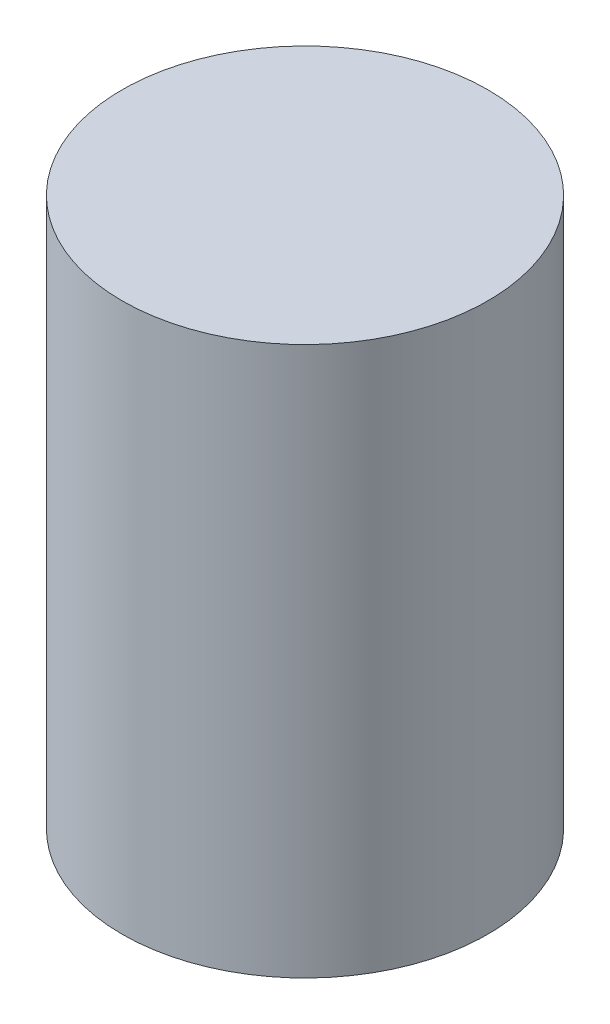
ISO-10303-21;
HEADER;
FILE_DESCRIPTION(('STEP AP214'),'2;1');
FILE_NAME('part.step','',(''),(''),'','','');
FILE_SCHEMA(('AUTOMOTIVE_DESIGN { 1 0 10303 214 1 1 1 1 }'));
ENDSEC;
DATA;
#1=APPLICATION_CONTEXT('core data for automotive mechanical design processes');
#2=APPLICATION_PROTOCOL_DEFINITION('international standard','automotive_design',2000,#1);
#3=PRODUCT_CONTEXT('',#1,'mechanical');
#4=PRODUCT('Part','Part','',(#3));
#5=PRODUCT_RELATED_PRODUCT_CATEGORY('part','',(#4));
#6=PRODUCT_DEFINITION_FORMATION('','',#4);
#7=PRODUCT_DEFINITION_CONTEXT('part definition',#1,'design');
#8=PRODUCT_DEFINITION('design','',#6,#7);
#9=PRODUCT_DEFINITION_SHAPE('','',#8);
#10=(LENGTH_UNIT() NAMED_UNIT(*) SI_UNIT(.MILLI.,.METRE.));
#11=(NAMED_UNIT(*) PLANE_ANGLE_UNIT() SI_UNIT($,.RADIAN.));
#12=(NAMED_UNIT(*) SI_UNIT($,.STERADIAN.) SOLID_ANGLE_UNIT());
#13=UNCERTAINTY_MEASURE_WITH_UNIT(LENGTH_MEASURE(1.E-05),#10,'distance_accuracy_value','');
#14=(GEOMETRIC_REPRESENTATION_CONTEXT(3) GLOBAL_UNCERTAINTY_ASSIGNED_CONTEXT((#13)) GLOBAL_UNIT_ASSIGNED_CONTEXT((#10,
#11,#12)) REPRESENTATION_CONTEXT('',''));
#15=CARTESIAN_POINT('',(0.,0.,0.));
#16=DIRECTION('',(0.,0.,1.));
#17=DIRECTION('',(1.,0.,0.));
#18=AXIS2_PLACEMENT_3D('',#15,#16,#17);
#19=CARTESIAN_POINT('',(0.,1500.,0.));
#20=DIRECTION('',(0.,-1.,0.));
#21=DIRECTION('',(0.,0.,-1.));
#22=AXIS2_PLACEMENT_3D('',#19,#20,#21);
#23=CYLINDRICAL_SURFACE('',#22,500.);
#24=CARTESIAN_POINT('',(0.,1500.,0.));
#25=DIRECTION('',(0.,1.,0.));
#26=DIRECTION('',(0.,0.,1.));
#27=AXIS2_PLACEMENT_3D('',#24,#25,#26);
#28=CIRCLE('',#27,500.);
#29=CARTESIAN_POINT('',(0.,1500.,500.));
#30=VERTEX_POINT('',#29);
#31=EDGE_CURVE('E10',#30,#30,#28,.T.);
#32=ORIENTED_EDGE('',*,*,#31,.F.);
#33=EDGE_LOOP('',(#32));
#34=FACE_BOUND('',#33,.T.);
#35=CARTESIAN_POINT('',(0.,0.,0.));
#36=DIRECTION('',(0.,1.,0.));
#37=DIRECTION('',(0.,0.,1.));
#38=AXIS2_PLACEMENT_3D('',#35,#36,#37);
#39=CIRCLE('',#38,500.);
#40=CARTESIAN_POINT('',(0.,0.,500.));
#41=VERTEX_POINT('',#40);
#42=EDGE_CURVE('E40',#41,#41,#39,.T.);
#43=ORIENTED_EDGE('',*,*,#42,.T.);
#44=EDGE_LOOP('',(#43));
#45=FACE_BOUND('',#44,.T.);
#46=ADVANCED_FACE('F37',(#34,#45),#23,.T.);
#47=CARTESIAN_POINT('',(0.,1500.,0.));
#48=DIRECTION('',(0.,1.,0.));
#49=DIRECTION('',(0.,0.,1.));
#50=AXIS2_PLACEMENT_3D('',#47,#48,#49);
#51=PLANE('',#50);
#52=ORIENTED_EDGE('',*,*,#31,.T.);
#53=EDGE_LOOP('',(#52));
#54=FACE_BOUND('',#53,.T.);
#55=ADVANCED_FACE('F52',(#54),#51,.T.);
#56=CARTESIAN_POINT('',(0.,0.,0.));
#57=DIRECTION('',(0.,1.,0.));
#58=DIRECTION('',(0.,0.,1.));
#59=AXIS2_PLACEMENT_3D('',#56,#57,#58);
#60=PLANE('',#59);
#61=ORIENTED_EDGE('',*,*,#42,.F.);
#62=EDGE_LOOP('',(#61));
#63=FACE_BOUND('',#62,.T.);
#64=ADVANCED_FACE('F50',(#63),#60,.F.);
#65=CLOSED_SHELL('',(#46,#55,#64));
#66=MANIFOLD_SOLID_BREP('B2',#65);
#67=ADVANCED_BREP_SHAPE_REPRESENTATION('',(#18,#66),#14);
#68=SHAPE_DEFINITION_REPRESENTATION(#9,#67);
ENDSEC;
END-ISO-10303-21;
